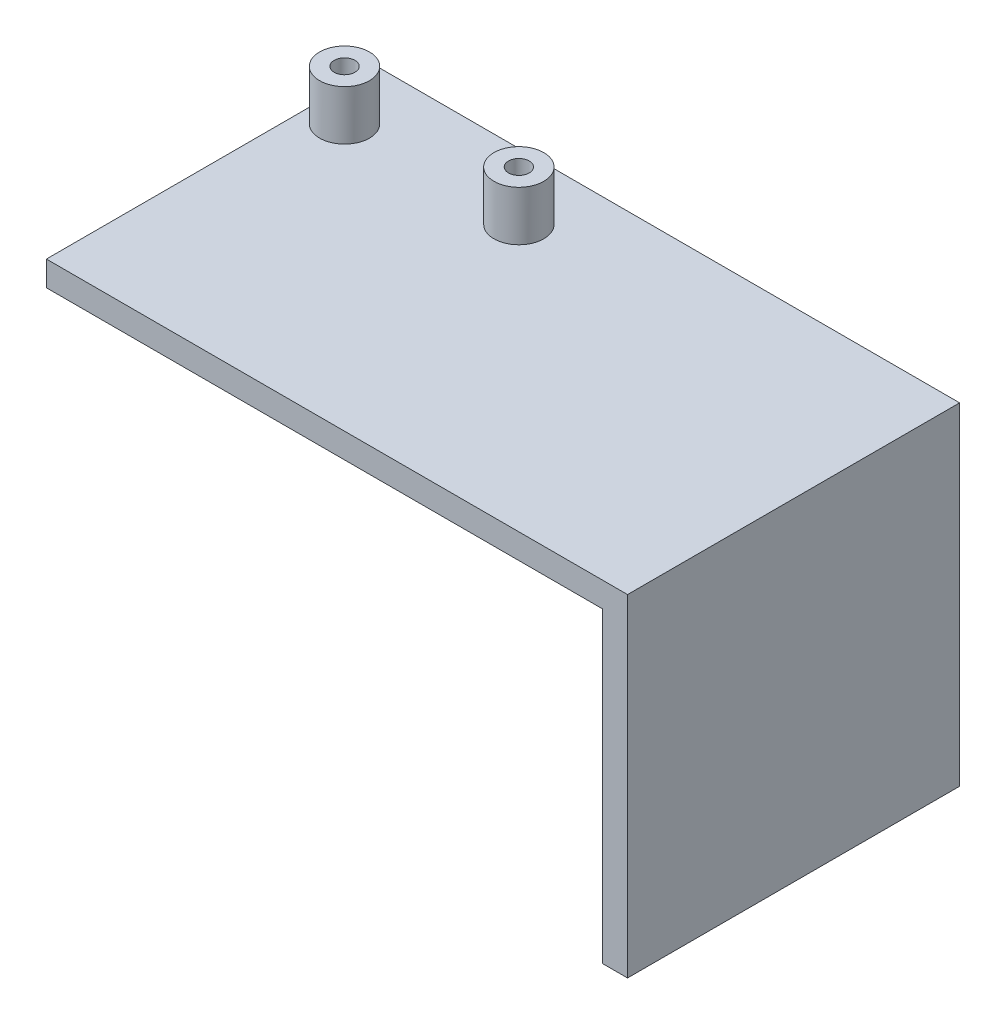
ISO-10303-21;
HEADER;
FILE_DESCRIPTION(('STEP AP214'),'2;1');
FILE_NAME('part.step','',(''),(''),'','','');
FILE_SCHEMA(('AUTOMOTIVE_DESIGN { 1 0 10303 214 1 1 1 1 }'));
ENDSEC;
DATA;
#1=APPLICATION_CONTEXT('core data for automotive mechanical design processes');
#2=APPLICATION_PROTOCOL_DEFINITION('international standard','automotive_design',2000,#1);
#3=PRODUCT_CONTEXT('',#1,'mechanical');
#4=PRODUCT('Part','Part','',(#3));
#5=PRODUCT_RELATED_PRODUCT_CATEGORY('part','',(#4));
#6=PRODUCT_DEFINITION_FORMATION('','',#4);
#7=PRODUCT_DEFINITION_CONTEXT('part definition',#1,'design');
#8=PRODUCT_DEFINITION('design','',#6,#7);
#9=PRODUCT_DEFINITION_SHAPE('','',#8);
#10=(LENGTH_UNIT() NAMED_UNIT(*) SI_UNIT(.MILLI.,.METRE.));
#11=(NAMED_UNIT(*) PLANE_ANGLE_UNIT() SI_UNIT($,.RADIAN.));
#12=(NAMED_UNIT(*) SI_UNIT($,.STERADIAN.) SOLID_ANGLE_UNIT());
#13=UNCERTAINTY_MEASURE_WITH_UNIT(LENGTH_MEASURE(1.E-05),#10,'distance_accuracy_value','');
#14=(GEOMETRIC_REPRESENTATION_CONTEXT(3) GLOBAL_UNCERTAINTY_ASSIGNED_CONTEXT((#13)) GLOBAL_UNIT_ASSIGNED_CONTEXT((#10,
#11,#12)) REPRESENTATION_CONTEXT('',''));
#15=CARTESIAN_POINT('',(0.,0.,0.));
#16=DIRECTION('',(0.,0.,1.));
#17=DIRECTION('',(1.,0.,0.));
#18=AXIS2_PLACEMENT_3D('',#15,#16,#17);
#19=CARTESIAN_POINT('',(35.,40.,20.));
#20=DIRECTION('',(-1.,0.,0.));
#21=DIRECTION('',(0.,0.,1.));
#22=AXIS2_PLACEMENT_3D('',#19,#20,#21);
#23=PLANE('',#22);
#24=DIRECTION('',(0.,0.,-1.));
#25=VECTOR('',#24,1.);
#26=CARTESIAN_POINT('',(35.,0.,20.));
#27=LINE('',#26,#25);
#28=CARTESIAN_POINT('',(35.,0.,20.));
#29=VERTEX_POINT('',#28);
#30=CARTESIAN_POINT('',(35.,0.,-20.));
#31=VERTEX_POINT('',#30);
#32=EDGE_CURVE('E159',#29,#31,#27,.T.);
#33=ORIENTED_EDGE('',*,*,#32,.T.);
#34=DIRECTION('',(0.,-1.,0.));
#35=VECTOR('',#34,1.);
#36=CARTESIAN_POINT('',(35.,40.,-20.));
#37=LINE('',#36,#35);
#38=CARTESIAN_POINT('',(35.,40.,-20.));
#39=VERTEX_POINT('',#38);
#40=EDGE_CURVE('E192',#39,#31,#37,.T.);
#41=ORIENTED_EDGE('',*,*,#40,.F.);
#42=DIRECTION('',(0.,0.,-1.));
#43=VECTOR('',#42,1.);
#44=CARTESIAN_POINT('',(35.,40.,20.));
#45=LINE('',#44,#43);
#46=CARTESIAN_POINT('',(35.,40.,20.));
#47=VERTEX_POINT('',#46);
#48=EDGE_CURVE('E162',#47,#39,#45,.T.);
#49=ORIENTED_EDGE('',*,*,#48,.F.);
#50=DIRECTION('',(0.,-1.,0.));
#51=VECTOR('',#50,1.);
#52=CARTESIAN_POINT('',(35.,40.,20.));
#53=LINE('',#52,#51);
#54=EDGE_CURVE('E172',#47,#29,#53,.T.);
#55=ORIENTED_EDGE('',*,*,#54,.T.);
#56=EDGE_LOOP('',(#33,#41,#49,#55));
#57=FACE_BOUND('',#56,.T.);
#58=ADVANCED_FACE('F39',(#57),#23,.F.);
#59=CARTESIAN_POINT('',(-35.,40.,-20.));
#60=DIRECTION('',(0.,0.,1.));
#61=DIRECTION('',(1.,0.,0.));
#62=AXIS2_PLACEMENT_3D('',#59,#60,#61);
#63=PLANE('',#62);
#64=DIRECTION('',(0.,-1.,0.));
#65=VECTOR('',#64,1.);
#66=CARTESIAN_POINT('',(32.,0.,-20.));
#67=LINE('',#66,#65);
#68=CARTESIAN_POINT('',(32.,37.,-20.));
#69=VERTEX_POINT('',#68);
#70=CARTESIAN_POINT('',(32.,0.,-20.));
#71=VERTEX_POINT('',#70);
#72=EDGE_CURVE('E54',#69,#71,#67,.T.);
#73=ORIENTED_EDGE('',*,*,#72,.F.);
#74=DIRECTION('',(-1.,0.,0.));
#75=VECTOR('',#74,1.);
#76=CARTESIAN_POINT('',(32.,37.,-20.));
#77=LINE('',#76,#75);
#78=CARTESIAN_POINT('',(-35.,37.,-20.));
#79=VERTEX_POINT('',#78);
#80=EDGE_CURVE('E155',#69,#79,#77,.T.);
#81=ORIENTED_EDGE('',*,*,#80,.T.);
#82=DIRECTION('',(0.,-1.,0.));
#83=VECTOR('',#82,1.);
#84=CARTESIAN_POINT('',(-35.,40.,-20.));
#85=LINE('',#84,#83);
#86=CARTESIAN_POINT('',(-35.,40.,-20.));
#87=VERTEX_POINT('',#86);
#88=EDGE_CURVE('E188',#87,#79,#85,.T.);
#89=ORIENTED_EDGE('',*,*,#88,.F.);
#90=DIRECTION('',(-1.,0.,0.));
#91=VECTOR('',#90,1.);
#92=CARTESIAN_POINT('',(-35.,40.,-20.));
#93=LINE('',#92,#91);
#94=EDGE_CURVE('E86',#39,#87,#93,.T.);
#95=ORIENTED_EDGE('',*,*,#94,.F.);
#96=ORIENTED_EDGE('',*,*,#40,.T.);
#97=DIRECTION('',(-1.,0.,0.));
#98=VECTOR('',#97,1.);
#99=CARTESIAN_POINT('',(-35.,0.,-20.));
#100=LINE('',#99,#98);
#101=EDGE_CURVE('E176',#31,#71,#100,.T.);
#102=ORIENTED_EDGE('',*,*,#101,.T.);
#103=EDGE_LOOP('',(#73,#81,#89,#95,#96,#102));
#104=FACE_BOUND('',#103,.T.);
#105=ADVANCED_FACE('F210',(#104),#63,.F.);
#106=CARTESIAN_POINT('',(-35.,40.,20.));
#107=DIRECTION('',(1.,0.,0.));
#108=DIRECTION('',(0.,0.,-1.));
#109=AXIS2_PLACEMENT_3D('',#106,#107,#108);
#110=PLANE('',#109);
#111=ORIENTED_EDGE('',*,*,#88,.T.);
#112=DIRECTION('',(0.,0.,-1.));
#113=VECTOR('',#112,1.);
#114=CARTESIAN_POINT('',(-35.,37.,-20.));
#115=LINE('',#114,#113);
#116=CARTESIAN_POINT('',(-35.,37.,20.));
#117=VERTEX_POINT('',#116);
#118=EDGE_CURVE('E140',#117,#79,#115,.T.);
#119=ORIENTED_EDGE('',*,*,#118,.F.);
#120=DIRECTION('',(0.,-1.,0.));
#121=VECTOR('',#120,1.);
#122=CARTESIAN_POINT('',(-35.,40.,20.));
#123=LINE('',#122,#121);
#124=CARTESIAN_POINT('',(-35.,40.,20.));
#125=VERTEX_POINT('',#124);
#126=EDGE_CURVE('E184',#125,#117,#123,.T.);
#127=ORIENTED_EDGE('',*,*,#126,.F.);
#128=DIRECTION('',(0.,0.,1.));
#129=VECTOR('',#128,1.);
#130=CARTESIAN_POINT('',(-35.,40.,20.));
#131=LINE('',#130,#129);
#132=EDGE_CURVE('E167',#87,#125,#131,.T.);
#133=ORIENTED_EDGE('',*,*,#132,.F.);
#134=EDGE_LOOP('',(#111,#119,#127,#133));
#135=FACE_BOUND('',#134,.T.);
#136=ADVANCED_FACE('F220',(#135),#110,.F.);
#137=CARTESIAN_POINT('',(-35.,40.,20.));
#138=DIRECTION('',(0.,0.,-1.));
#139=DIRECTION('',(-1.,0.,0.));
#140=AXIS2_PLACEMENT_3D('',#137,#138,#139);
#141=PLANE('',#140);
#142=ORIENTED_EDGE('',*,*,#126,.T.);
#143=DIRECTION('',(-1.,0.,0.));
#144=VECTOR('',#143,1.);
#145=CARTESIAN_POINT('',(32.,37.,20.));
#146=LINE('',#145,#144);
#147=CARTESIAN_POINT('',(32.,37.,20.));
#148=VERTEX_POINT('',#147);
#149=EDGE_CURVE('E152',#148,#117,#146,.T.);
#150=ORIENTED_EDGE('',*,*,#149,.F.);
#151=DIRECTION('',(0.,1.,0.));
#152=VECTOR('',#151,1.);
#153=CARTESIAN_POINT('',(32.,0.,20.));
#154=LINE('',#153,#152);
#155=CARTESIAN_POINT('',(32.,0.,20.));
#156=VERTEX_POINT('',#155);
#157=EDGE_CURVE('E146',#156,#148,#154,.T.);
#158=ORIENTED_EDGE('',*,*,#157,.F.);
#159=DIRECTION('',(1.,0.,0.));
#160=VECTOR('',#159,1.);
#161=CARTESIAN_POINT('',(-35.,0.,20.));
#162=LINE('',#161,#160);
#163=EDGE_CURVE('E78',#156,#29,#162,.T.);
#164=ORIENTED_EDGE('',*,*,#163,.T.);
#165=ORIENTED_EDGE('',*,*,#54,.F.);
#166=DIRECTION('',(1.,0.,0.));
#167=VECTOR('',#166,1.);
#168=CARTESIAN_POINT('',(-35.,40.,20.));
#169=LINE('',#168,#167);
#170=EDGE_CURVE('E63',#125,#47,#169,.T.);
#171=ORIENTED_EDGE('',*,*,#170,.F.);
#172=EDGE_LOOP('',(#142,#150,#158,#164,#165,#171));
#173=FACE_BOUND('',#172,.T.);
#174=ADVANCED_FACE('F203',(#173),#141,.F.);
#175=CARTESIAN_POINT('',(0.,40.,0.));
#176=DIRECTION('',(0.,-1.,0.));
#177=DIRECTION('',(0.,0.,-1.));
#178=AXIS2_PLACEMENT_3D('',#175,#176,#177);
#179=PLANE('',#178);
#180=CARTESIAN_POINT('',(-31.149822543583,40.,-12.0627680002006));
#181=DIRECTION('',(0.,-1.,0.));
#182=DIRECTION('',(0.,0.,-1.));
#183=AXIS2_PLACEMENT_3D('',#180,#181,#182);
#184=CIRCLE('',#183,3.);
#185=CARTESIAN_POINT('',(-31.149822543583,40.,-15.0627680002006));
#186=VERTEX_POINT('',#185);
#187=EDGE_CURVE('E11',#186,#186,#184,.F.);
#188=ORIENTED_EDGE('',*,*,#187,.F.);
#189=EDGE_LOOP('',(#188));
#190=FACE_BOUND('',#189,.T.);
#191=CARTESIAN_POINT('',(-10.149822543583,40.,-12.0627680002006));
#192=DIRECTION('',(0.,-1.,0.));
#193=DIRECTION('',(0.,0.,-1.));
#194=AXIS2_PLACEMENT_3D('',#191,#192,#193);
#195=CIRCLE('',#194,3.);
#196=CARTESIAN_POINT('',(-10.149822543583,40.,-15.0627680002006));
#197=VERTEX_POINT('',#196);
#198=EDGE_CURVE('E47',#197,#197,#195,.F.);
#199=ORIENTED_EDGE('',*,*,#198,.F.);
#200=EDGE_LOOP('',(#199));
#201=FACE_BOUND('',#200,.T.);
#202=ORIENTED_EDGE('',*,*,#48,.T.);
#203=ORIENTED_EDGE('',*,*,#94,.T.);
#204=ORIENTED_EDGE('',*,*,#132,.T.);
#205=ORIENTED_EDGE('',*,*,#170,.T.);
#206=EDGE_LOOP('',(#202,#203,#204,#205));
#207=FACE_BOUND('',#206,.T.);
#208=ADVANCED_FACE('F200',(#190,#201,#207),#179,.F.);
#209=CARTESIAN_POINT('',(0.,0.,0.));
#210=DIRECTION('',(0.,-1.,0.));
#211=DIRECTION('',(0.,0.,-1.));
#212=AXIS2_PLACEMENT_3D('',#209,#210,#211);
#213=PLANE('',#212);
#214=DIRECTION('',(0.,0.,1.));
#215=VECTOR('',#214,1.);
#216=CARTESIAN_POINT('',(32.,0.,-20.));
#217=LINE('',#216,#215);
#218=EDGE_CURVE('E143',#71,#156,#217,.T.);
#219=ORIENTED_EDGE('',*,*,#218,.F.);
#220=ORIENTED_EDGE('',*,*,#101,.F.);
#221=ORIENTED_EDGE('',*,*,#32,.F.);
#222=ORIENTED_EDGE('',*,*,#163,.F.);
#223=EDGE_LOOP('',(#219,#220,#221,#222));
#224=FACE_BOUND('',#223,.T.);
#225=ADVANCED_FACE('F202',(#224),#213,.T.);
#226=CARTESIAN_POINT('',(32.,37.,-20.));
#227=DIRECTION('',(0.,1.,0.));
#228=DIRECTION('',(0.,0.,1.));
#229=AXIS2_PLACEMENT_3D('',#226,#227,#228);
#230=PLANE('',#229);
#231=ORIENTED_EDGE('',*,*,#118,.T.);
#232=ORIENTED_EDGE('',*,*,#80,.F.);
#233=DIRECTION('',(0.,0.,-1.));
#234=VECTOR('',#233,1.);
#235=CARTESIAN_POINT('',(32.,37.,-20.));
#236=LINE('',#235,#234);
#237=EDGE_CURVE('E149',#148,#69,#236,.T.);
#238=ORIENTED_EDGE('',*,*,#237,.F.);
#239=ORIENTED_EDGE('',*,*,#149,.T.);
#240=EDGE_LOOP('',(#231,#232,#238,#239));
#241=FACE_BOUND('',#240,.T.);
#242=ADVANCED_FACE('F218',(#241),#230,.F.);
#243=CARTESIAN_POINT('',(32.,0.,0.));
#244=DIRECTION('',(1.,0.,0.));
#245=DIRECTION('',(0.,0.,-1.));
#246=AXIS2_PLACEMENT_3D('',#243,#244,#245);
#247=PLANE('',#246);
#248=ORIENTED_EDGE('',*,*,#72,.T.);
#249=ORIENTED_EDGE('',*,*,#218,.T.);
#250=ORIENTED_EDGE('',*,*,#157,.T.);
#251=ORIENTED_EDGE('',*,*,#237,.T.);
#252=EDGE_LOOP('',(#248,#249,#250,#251));
#253=FACE_BOUND('',#252,.T.);
#254=ADVANCED_FACE('F212',(#253),#247,.F.);
#255=CARTESIAN_POINT('',(-10.149822543583,46.,-12.0627680002006));
#256=DIRECTION('',(0.,-1.,0.));
#257=DIRECTION('',(0.,0.,-1.));
#258=AXIS2_PLACEMENT_3D('',#255,#256,#257);
#259=CYLINDRICAL_SURFACE('',#258,3.);
#260=CARTESIAN_POINT('',(-10.149822543583,46.,-12.0627680002006));
#261=DIRECTION('',(0.,1.,0.));
#262=DIRECTION('',(0.,0.,1.));
#263=AXIS2_PLACEMENT_3D('',#260,#261,#262);
#264=CIRCLE('',#263,3.);
#265=CARTESIAN_POINT('',(-10.149822543583,46.,-9.06276800020062));
#266=VERTEX_POINT('',#265);
#267=EDGE_CURVE('E136',#266,#266,#264,.T.);
#268=ORIENTED_EDGE('',*,*,#267,.F.);
#269=EDGE_LOOP('',(#268));
#270=FACE_BOUND('',#269,.T.);
#271=ORIENTED_EDGE('',*,*,#198,.T.);
#272=EDGE_LOOP('',(#271));
#273=FACE_BOUND('',#272,.T.);
#274=ADVANCED_FACE('F198',(#270,#273),#259,.T.);
#275=CARTESIAN_POINT('',(-10.149822543583,46.,-12.0627680002006));
#276=DIRECTION('',(0.,1.,0.));
#277=DIRECTION('',(0.,0.,1.));
#278=AXIS2_PLACEMENT_3D('',#275,#276,#277);
#279=PLANE('',#278);
#280=CARTESIAN_POINT('',(-10.149822543583,46.,-12.0627680002006));
#281=DIRECTION('',(0.,1.,0.));
#282=DIRECTION('',(0.,0.,1.));
#283=AXIS2_PLACEMENT_3D('',#280,#281,#282);
#284=CIRCLE('',#283,1.24999999999999);
#285=CARTESIAN_POINT('',(-10.149822543583,46.,-10.8127680002006));
#286=VERTEX_POINT('',#285);
#287=EDGE_CURVE('E118',#286,#286,#284,.T.);
#288=ORIENTED_EDGE('',*,*,#287,.F.);
#289=EDGE_LOOP('',(#288));
#290=FACE_BOUND('',#289,.T.);
#291=ORIENTED_EDGE('',*,*,#267,.T.);
#292=EDGE_LOOP('',(#291));
#293=FACE_BOUND('',#292,.T.);
#294=ADVANCED_FACE('F285',(#290,#293),#279,.T.);
#295=CARTESIAN_POINT('',(-31.149822543583,46.,-12.0627680002006));
#296=DIRECTION('',(0.,-1.,0.));
#297=DIRECTION('',(0.,0.,-1.));
#298=AXIS2_PLACEMENT_3D('',#295,#296,#297);
#299=CYLINDRICAL_SURFACE('',#298,3.);
#300=CARTESIAN_POINT('',(-31.149822543583,46.,-12.0627680002006));
#301=DIRECTION('',(0.,1.,0.));
#302=DIRECTION('',(0.,0.,1.));
#303=AXIS2_PLACEMENT_3D('',#300,#301,#302);
#304=CIRCLE('',#303,3.);
#305=CARTESIAN_POINT('',(-31.149822543583,46.,-9.06276800020062));
#306=VERTEX_POINT('',#305);
#307=EDGE_CURVE('E132',#306,#306,#304,.T.);
#308=ORIENTED_EDGE('',*,*,#307,.F.);
#309=EDGE_LOOP('',(#308));
#310=FACE_BOUND('',#309,.T.);
#311=ORIENTED_EDGE('',*,*,#187,.T.);
#312=EDGE_LOOP('',(#311));
#313=FACE_BOUND('',#312,.T.);
#314=ADVANCED_FACE('F293',(#310,#313),#299,.T.);
#315=CARTESIAN_POINT('',(-31.149822543583,46.,-12.0627680002006));
#316=DIRECTION('',(0.,1.,0.));
#317=DIRECTION('',(0.,0.,1.));
#318=AXIS2_PLACEMENT_3D('',#315,#316,#317);
#319=PLANE('',#318);
#320=CARTESIAN_POINT('',(-31.149822543583,46.,-12.0627680002006));
#321=DIRECTION('',(0.,1.,0.));
#322=DIRECTION('',(0.,0.,1.));
#323=AXIS2_PLACEMENT_3D('',#320,#321,#322);
#324=CIRCLE('',#323,1.24999999999999);
#325=CARTESIAN_POINT('',(-31.149822543583,46.,-10.8127680002006));
#326=VERTEX_POINT('',#325);
#327=EDGE_CURVE('E119',#326,#326,#324,.T.);
#328=ORIENTED_EDGE('',*,*,#327,.F.);
#329=EDGE_LOOP('',(#328));
#330=FACE_BOUND('',#329,.T.);
#331=ORIENTED_EDGE('',*,*,#307,.T.);
#332=EDGE_LOOP('',(#331));
#333=FACE_BOUND('',#332,.T.);
#334=ADVANCED_FACE('F298',(#330,#333),#319,.T.);
#335=CARTESIAN_POINT('',(-10.149822543583,40.,-12.0627680002006));
#336=DIRECTION('',(0.,1.,0.));
#337=DIRECTION('',(0.,0.,1.));
#338=AXIS2_PLACEMENT_3D('',#335,#336,#337);
#339=CONICAL_SURFACE('',#338,1.24999999999999,1.02974425867665);
#340=CARTESIAN_POINT('',(-10.149822543583,39.2489242262155,-12.0627680002006));
#341=VERTEX_POINT('',#340);
#342=VERTEX_LOOP('',#341);
#343=FACE_BOUND('',#342,.T.);
#344=CARTESIAN_POINT('',(-10.149822543583,40.,-12.0627680002006));
#345=DIRECTION('',(0.,1.,0.));
#346=DIRECTION('',(0.,0.,1.));
#347=AXIS2_PLACEMENT_3D('',#344,#345,#346);
#348=CIRCLE('',#347,1.24999999999999);
#349=CARTESIAN_POINT('',(-10.149822543583,40.,-10.8127680002006));
#350=VERTEX_POINT('',#349);
#351=EDGE_CURVE('E124',#350,#350,#348,.T.);
#352=ORIENTED_EDGE('',*,*,#351,.T.);
#353=EDGE_LOOP('',(#352));
#354=FACE_BOUND('',#353,.T.);
#355=ADVANCED_FACE('F315',(#343,#354),#339,.F.);
#356=CARTESIAN_POINT('',(-10.149822543583,46.,-12.0627680002006));
#357=DIRECTION('',(0.,1.,0.));
#358=DIRECTION('',(0.,0.,1.));
#359=AXIS2_PLACEMENT_3D('',#356,#357,#358);
#360=CYLINDRICAL_SURFACE('',#359,1.24999999999999);
#361=ORIENTED_EDGE('',*,*,#351,.F.);
#362=EDGE_LOOP('',(#361));
#363=FACE_BOUND('',#362,.T.);
#364=ORIENTED_EDGE('',*,*,#287,.T.);
#365=EDGE_LOOP('',(#364));
#366=FACE_BOUND('',#365,.T.);
#367=ADVANCED_FACE('F111',(#363,#366),#360,.F.);
#368=CARTESIAN_POINT('',(-31.149822543583,40.,-12.0627680002006));
#369=DIRECTION('',(0.,1.,0.));
#370=DIRECTION('',(0.,0.,1.));
#371=AXIS2_PLACEMENT_3D('',#368,#369,#370);
#372=CONICAL_SURFACE('',#371,1.24999999999999,1.02974425867665);
#373=CARTESIAN_POINT('',(-31.149822543583,39.2489242262155,-12.0627680002006));
#374=VERTEX_POINT('',#373);
#375=VERTEX_LOOP('',#374);
#376=FACE_BOUND('',#375,.T.);
#377=CARTESIAN_POINT('',(-31.149822543583,40.,-12.0627680002006));
#378=DIRECTION('',(0.,1.,0.));
#379=DIRECTION('',(0.,0.,1.));
#380=AXIS2_PLACEMENT_3D('',#377,#378,#379);
#381=CIRCLE('',#380,1.24999999999999);
#382=CARTESIAN_POINT('',(-31.149822543583,40.,-10.8127680002006));
#383=VERTEX_POINT('',#382);
#384=EDGE_CURVE('E115',#383,#383,#381,.T.);
#385=ORIENTED_EDGE('',*,*,#384,.T.);
#386=EDGE_LOOP('',(#385));
#387=FACE_BOUND('',#386,.T.);
#388=ADVANCED_FACE('F107',(#376,#387),#372,.F.);
#389=CARTESIAN_POINT('',(-31.149822543583,46.,-12.0627680002006));
#390=DIRECTION('',(0.,1.,0.));
#391=DIRECTION('',(0.,0.,1.));
#392=AXIS2_PLACEMENT_3D('',#389,#390,#391);
#393=CYLINDRICAL_SURFACE('',#392,1.24999999999999);
#394=ORIENTED_EDGE('',*,*,#384,.F.);
#395=EDGE_LOOP('',(#394));
#396=FACE_BOUND('',#395,.T.);
#397=ORIENTED_EDGE('',*,*,#327,.T.);
#398=EDGE_LOOP('',(#397));
#399=FACE_BOUND('',#398,.T.);
#400=ADVANCED_FACE('F110',(#396,#399),#393,.F.);
#401=CLOSED_SHELL('',(#58,#105,#136,#174,#208,#225,#242,#254,#274,#294,#314,#334,#355,#367,#388,#400));
#402=MANIFOLD_SOLID_BREP('B2',#401);
#403=ADVANCED_BREP_SHAPE_REPRESENTATION('',(#18,#402),#14);
#404=SHAPE_DEFINITION_REPRESENTATION(#9,#403);
ENDSEC;
END-ISO-10303-21;
